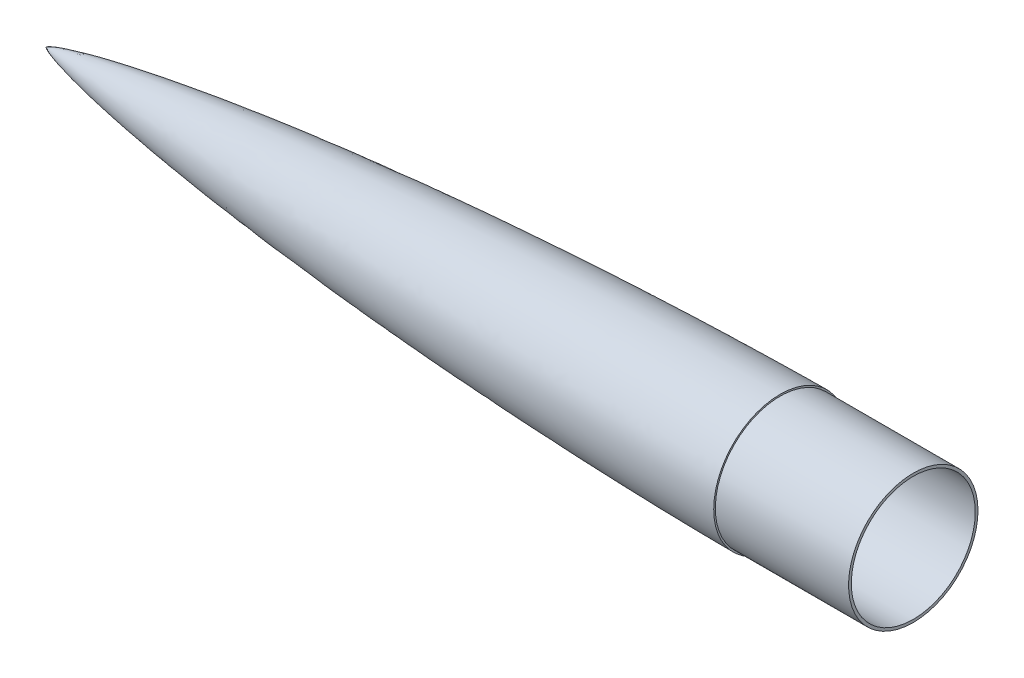
ISO-10303-21;
HEADER;
FILE_DESCRIPTION(('STEP AP214'),'2;1');
FILE_NAME('part.step','',(''),(''),'','','');
FILE_SCHEMA(('AUTOMOTIVE_DESIGN { 1 0 10303 214 1 1 1 1 }'));
ENDSEC;
DATA;
#1=APPLICATION_CONTEXT('core data for automotive mechanical design processes');
#2=APPLICATION_PROTOCOL_DEFINITION('international standard','automotive_design',2000,#1);
#3=PRODUCT_CONTEXT('',#1,'mechanical');
#4=PRODUCT('Part','Part','',(#3));
#5=PRODUCT_RELATED_PRODUCT_CATEGORY('part','',(#4));
#6=PRODUCT_DEFINITION_FORMATION('','',#4);
#7=PRODUCT_DEFINITION_CONTEXT('part definition',#1,'design');
#8=PRODUCT_DEFINITION('design','',#6,#7);
#9=PRODUCT_DEFINITION_SHAPE('','',#8);
#10=(LENGTH_UNIT() NAMED_UNIT(*) SI_UNIT(.MILLI.,.METRE.));
#11=(NAMED_UNIT(*) PLANE_ANGLE_UNIT() SI_UNIT($,.RADIAN.));
#12=(NAMED_UNIT(*) SI_UNIT($,.STERADIAN.) SOLID_ANGLE_UNIT());
#13=UNCERTAINTY_MEASURE_WITH_UNIT(LENGTH_MEASURE(1.E-05),#10,'distance_accuracy_value','');
#14=(GEOMETRIC_REPRESENTATION_CONTEXT(3) GLOBAL_UNCERTAINTY_ASSIGNED_CONTEXT((#13)) GLOBAL_UNIT_ASSIGNED_CONTEXT((#10,
#11,#12)) REPRESENTATION_CONTEXT('',''));
#15=CARTESIAN_POINT('',(0.,0.,0.));
#16=DIRECTION('',(0.,0.,1.));
#17=DIRECTION('',(1.,0.,0.));
#18=AXIS2_PLACEMENT_3D('',#15,#16,#17);
#19=CARTESIAN_POINT('',(-1.11022302462516E-13,50.8,0.));
#20=CARTESIAN_POINT('',(-2.14934923743526,50.7973507801545,0.));
#21=CARTESIAN_POINT('',(-6.44800999808848,50.7770624679067,0.));
#22=CARTESIAN_POINT('',(-15.0451777232877,50.7121883540089,0.));
#23=CARTESIAN_POINT('',(-32.3803918990792,50.5082144768032,0.));
#24=CARTESIAN_POINT('',(-56.3029065485733,50.090776648842,0.));
#25=CARTESIAN_POINT('',(-86.809787655482,49.3489831202033,0.));
#26=CARTESIAN_POINT('',(-121.747977164394,48.2271000379053,0.));
#27=CARTESIAN_POINT('',(-156.67647109036,46.8357681607493,0.));
#28=CARTESIAN_POINT('',(-191.593009434118,45.1706384633514,0.));
#29=CARTESIAN_POINT('',(-226.49494926724,43.2230355543889,0.));
#30=CARTESIAN_POINT('',(-261.379230807222,40.9803744355786,0.));
#31=CARTESIAN_POINT('',(-296.242069035725,38.425472621022,0.));
#32=CARTESIAN_POINT('',(-331.078892316415,35.5359559537165,0.));
#33=CARTESIAN_POINT('',(-365.883526915384,32.2808737670788,0.));
#34=CARTESIAN_POINT('',(-400.647967928913,28.6186220405836,0.));
#35=CARTESIAN_POINT('',(-435.35983834691,24.4860300966533,0.));
#36=CARTESIAN_POINT('',(-469.301869443746,19.8827350784447,0.));
#37=CARTESIAN_POINT('',(-498.824446520948,15.2498074933727,0.));
#38=CARTESIAN_POINT('',(-522.445985272802,10.9255150864351,0.));
#39=CARTESIAN_POINT('',(-538.983933312556,7.34770992266022,0.));
#40=CARTESIAN_POINT('',(-548.503001455136,4.95573700022913,0.));
#41=CARTESIAN_POINT('',(-554.236371735965,3.2830490655868,0.));
#42=CARTESIAN_POINT('',(-557.458840588358,2.19734023006858,0.));
#43=CARTESIAN_POINT('',(-559.255777461946,1.50550461272677,0.));
#44=CARTESIAN_POINT('',(-560.275927400277,1.06127371455853,0.));
#45=CARTESIAN_POINT('',(-560.840298469006,0.787022959066489,0.));
#46=CARTESIAN_POINT('',(-561.169653139726,0.611597666558901,0.));
#47=CARTESIAN_POINT('',(-561.38021405753,0.490628162270949,0.));
#48=CARTESIAN_POINT('',(-561.523808969643,0.403162175557425,0.));
#49=CARTESIAN_POINT('',(-561.648819363266,0.321264997558828,0.));
#50=CARTESIAN_POINT('',(-561.755310693662,0.245344087659571,0.));
#51=CARTESIAN_POINT('',(-561.843876844838,0.175539616491447,0.));
#52=CARTESIAN_POINT('',(-561.906151097484,0.120689544505142,0.));
#53=CARTESIAN_POINT('',(-561.951678038106,0.0740094476962299,0.));
#54=CARTESIAN_POINT('',(-561.981306411724,0.0368858399056971,0.));
#55=CARTESIAN_POINT('',(-561.99374148433,0.0166551926729426,0.));
#56=CARTESIAN_POINT('',(-561.99818744585,0.00568588730699545,0.));
#57=CARTESIAN_POINT('',(-562.,0.,0.));
#58=B_SPLINE_CURVE_WITH_KNOTS('',4,(#19,#20,#21,#22,#23,#24,#25,#26,#27,#28,#29,#30,#31,#32,#33,
#34,#35,#36,#37,#38,#39,#40,#41,#42,#43,#44,#45,#46,#47,#48,#49,#50,#51,#52,#53,#54,#55,#56,
#57),.UNSPECIFIED.,.F.,.F.,(5,1,1,1,1,1,1,1,1,1,1,1,1,1,1,1,1,1,1,1,1,1,1,1,1,1,1,1,1,1,1,1,1,1,
1,5),(0.,0.0151976977337696,0.0303953954675391,0.0607907909350783,0.122582570486079,
0.184374349992458,0.246166129185985,0.307957909017478,0.369749688256446,0.43154146726618,
0.493333246918285,0.555125027289001,0.616916805965979,0.678708584538909,0.740500363269972,
0.802292142714057,0.864083922076652,0.920889993828207,0.95178589022563,0.972065434254083,
0.983707285900985,0.990276130770751,0.994005292011036,0.99610267991479,0.997318404630745,
0.998141356988284,0.998440998609813,0.998740640231341,0.999035334859011,0.999330029486681,
0.999497522115011,0.99966501474334,0.99983250737167,0.999916253685835,0.999958126842918,1.),.UNSPECIFIED.);
#59=CARTESIAN_POINT('',(-562.,0.,0.));
#60=DIRECTION('',(-1.,0.,0.));
#61=AXIS1_PLACEMENT('',#59,#60);
#62=SURFACE_OF_REVOLUTION('',#58,#61);
#63=CARTESIAN_POINT('',(-562.,0.,0.));
#64=VERTEX_POINT('',#63);
#65=VERTEX_LOOP('',#64);
#66=FACE_BOUND('',#65,.T.);
#67=CARTESIAN_POINT('',(0.,0.,0.));
#68=DIRECTION('',(-1.,0.,0.));
#69=DIRECTION('',(0.,-1.,0.));
#70=AXIS2_PLACEMENT_3D('',#67,#68,#69);
#71=CIRCLE('',#70,50.8);
#72=CARTESIAN_POINT('',(0.,-50.8,0.));
#73=VERTEX_POINT('',#72);
#74=EDGE_CURVE('E41',#73,#73,#71,.T.);
#75=ORIENTED_EDGE('',*,*,#74,.T.);
#76=EDGE_LOOP('',(#75));
#77=FACE_BOUND('',#76,.T.);
#78=ADVANCED_FACE('F33',(#66,#77),#62,.T.);
#79=CARTESIAN_POINT('',(0.,0.,0.));
#80=DIRECTION('',(-1.,0.,0.));
#81=DIRECTION('',(0.,-1.,0.));
#82=AXIS2_PLACEMENT_3D('',#79,#80,#81);
#83=PLANE('',#82);
#84=CARTESIAN_POINT('',(0.,0.,0.));
#85=DIRECTION('',(-1.,0.,0.));
#86=DIRECTION('',(0.,-1.,0.));
#87=AXIS2_PLACEMENT_3D('',#84,#85,#86);
#88=CIRCLE('',#87,49.55);
#89=CARTESIAN_POINT('',(0.,-49.55,0.));
#90=VERTEX_POINT('',#89);
#91=EDGE_CURVE('E11',#90,#90,#88,.F.);
#92=ORIENTED_EDGE('',*,*,#91,.F.);
#93=EDGE_LOOP('',(#92));
#94=FACE_BOUND('',#93,.T.);
#95=ORIENTED_EDGE('',*,*,#74,.F.);
#96=EDGE_LOOP('',(#95));
#97=FACE_BOUND('',#96,.T.);
#98=ADVANCED_FACE('F88',(#94,#97),#83,.F.);
#99=CARTESIAN_POINT('',(102.,0.,0.));
#100=DIRECTION('',(-1.,0.,0.));
#101=DIRECTION('',(0.,0.,1.));
#102=AXIS2_PLACEMENT_3D('',#99,#100,#101);
#103=CYLINDRICAL_SURFACE('',#102,49.55);
#104=CARTESIAN_POINT('',(102.,0.,0.));
#105=DIRECTION('',(1.,0.,0.));
#106=DIRECTION('',(0.,0.,-1.));
#107=AXIS2_PLACEMENT_3D('',#104,#105,#106);
#108=CIRCLE('',#107,49.55);
#109=CARTESIAN_POINT('',(102.,0.,-49.55));
#110=VERTEX_POINT('',#109);
#111=EDGE_CURVE('E61',#110,#110,#108,.T.);
#112=ORIENTED_EDGE('',*,*,#111,.F.);
#113=EDGE_LOOP('',(#112));
#114=FACE_BOUND('',#113,.T.);
#115=ORIENTED_EDGE('',*,*,#91,.T.);
#116=EDGE_LOOP('',(#115));
#117=FACE_BOUND('',#116,.T.);
#118=ADVANCED_FACE('F85',(#114,#117),#103,.T.);
#119=CARTESIAN_POINT('',(102.,0.,0.));
#120=DIRECTION('',(1.,0.,0.));
#121=DIRECTION('',(0.,0.,-1.));
#122=AXIS2_PLACEMENT_3D('',#119,#120,#121);
#123=PLANE('',#122);
#124=CARTESIAN_POINT('',(102.,0.,0.));
#125=DIRECTION('',(1.,0.,0.));
#126=DIRECTION('',(0.,0.,-1.));
#127=AXIS2_PLACEMENT_3D('',#124,#125,#126);
#128=CIRCLE('',#127,47.45);
#129=CARTESIAN_POINT('',(102.,0.,-47.45));
#130=VERTEX_POINT('',#129);
#131=EDGE_CURVE('E58',#130,#130,#128,.T.);
#132=ORIENTED_EDGE('',*,*,#131,.F.);
#133=EDGE_LOOP('',(#132));
#134=FACE_BOUND('',#133,.T.);
#135=ORIENTED_EDGE('',*,*,#111,.T.);
#136=EDGE_LOOP('',(#135));
#137=FACE_BOUND('',#136,.T.);
#138=ADVANCED_FACE('F51',(#134,#137),#123,.T.);
#139=CARTESIAN_POINT('',(-1.11022302462516E-13,50.8,0.));
#140=CARTESIAN_POINT('',(-2.14934923743526,50.7973507801545,0.));
#141=CARTESIAN_POINT('',(-6.44800999808848,50.7770624679067,0.));
#142=CARTESIAN_POINT('',(-15.0451777232877,50.7121883540089,0.));
#143=CARTESIAN_POINT('',(-32.3803918990792,50.5082144768032,0.));
#144=CARTESIAN_POINT('',(-56.3029065485733,50.090776648842,0.));
#145=CARTESIAN_POINT('',(-86.809787655482,49.3489831202033,0.));
#146=CARTESIAN_POINT('',(-121.747977164394,48.2271000379053,0.));
#147=CARTESIAN_POINT('',(-156.67647109036,46.8357681607493,0.));
#148=CARTESIAN_POINT('',(-191.593009434118,45.1706384633514,0.));
#149=CARTESIAN_POINT('',(-226.49494926724,43.2230355543889,0.));
#150=CARTESIAN_POINT('',(-261.379230807222,40.9803744355786,0.));
#151=CARTESIAN_POINT('',(-296.242069035725,38.425472621022,0.));
#152=CARTESIAN_POINT('',(-331.078892316415,35.5359559537165,0.));
#153=CARTESIAN_POINT('',(-365.883526915384,32.2808737670788,0.));
#154=CARTESIAN_POINT('',(-400.647967928913,28.6186220405836,0.));
#155=CARTESIAN_POINT('',(-435.35983834691,24.4860300966533,0.));
#156=CARTESIAN_POINT('',(-469.301869443746,19.8827350784447,0.));
#157=CARTESIAN_POINT('',(-498.824446520948,15.2498074933727,0.));
#158=CARTESIAN_POINT('',(-522.445985272802,10.9255150864351,0.));
#159=CARTESIAN_POINT('',(-538.983933312556,7.34770992266022,0.));
#160=CARTESIAN_POINT('',(-548.503001455136,4.95573700022913,0.));
#161=CARTESIAN_POINT('',(-553.977475078638,3.35858113378033,0.));
#162=CARTESIAN_POINT('',(-556.666207046048,2.46337676864576,0.));
#163=CARTESIAN_POINT('',(-557.781972700868,2.05889256813271,0.));
#164=CARTESIAN_POINT('',(-558.023720538431,1.96940712096563,0.));
#165=B_SPLINE_CURVE_WITH_KNOTS('',4,(#139,#140,#141,#142,#143,#144,#145,#146,#147,#148,#149,
#150,#151,#152,#153,#154,#155,#156,#157,#158,#159,#160,#161,#162,#163,#164),.UNSPECIFIED.,.F.,
.F.,(5,1,1,1,1,1,1,1,1,1,1,1,1,1,1,1,1,1,1,1,1,1,5),(0.,0.0151976977337696,0.0303953954675391,
0.0607907909350783,0.122582570486079,0.184374349992458,0.246166129185985,0.307957909017478,
0.369749688256446,0.43154146726618,0.493333246918285,0.555125027289001,0.616916805965979,
0.678708584538909,0.740500363269972,0.802292142714057,0.864083922076652,0.920889993828207,
0.95178589022563,0.972065434254083,0.983707285900985,0.990276130770751,0.99209882836728),.UNSPECIFIED.);
#166=CARTESIAN_POINT('',(-562.,0.,0.));
#167=DIRECTION('',(-1.,0.,0.));
#168=AXIS1_PLACEMENT('',#166,#167);
#169=SURFACE_OF_REVOLUTION('',#165,#168);
#170=OFFSET_SURFACE('',#169,-2.1,.F.);
#171=CARTESIAN_POINT('',(-557.294724247706,0.,0.));
#172=VERTEX_POINT('',#171);
#173=VERTEX_LOOP('',#172);
#174=FACE_BOUND('',#173,.T.);
#175=CARTESIAN_POINT('',(-21.,0.,0.));
#176=DIRECTION('',(-1.,0.,0.));
#177=DIRECTION('',(0.,-1.,0.));
#178=AXIS2_PLACEMENT_3D('',#175,#176,#177);
#179=CIRCLE('',#178,48.5372882607637);
#180=CARTESIAN_POINT('',(-21.,-48.5372882607637,0.));
#181=VERTEX_POINT('',#180);
#182=EDGE_CURVE('E55',#181,#181,#179,.T.);
#183=ORIENTED_EDGE('',*,*,#182,.F.);
#184=EDGE_LOOP('',(#183));
#185=FACE_BOUND('',#184,.T.);
#186=ADVANCED_FACE('F47',(#174,#185),#170,.F.);
#187=CARTESIAN_POINT('',(-21.,0.,0.));
#188=DIRECTION('',(-1.,0.,0.));
#189=DIRECTION('',(0.,-1.,0.));
#190=AXIS2_PLACEMENT_3D('',#187,#188,#189);
#191=PLANE('',#190);
#192=CARTESIAN_POINT('',(-21.,0.,0.));
#193=DIRECTION('',(-1.,0.,0.));
#194=DIRECTION('',(0.,-1.,0.));
#195=AXIS2_PLACEMENT_3D('',#192,#193,#194);
#196=CIRCLE('',#195,47.45);
#197=CARTESIAN_POINT('',(-21.,-47.45,0.));
#198=VERTEX_POINT('',#197);
#199=EDGE_CURVE('E57',#198,#198,#196,.F.);
#200=ORIENTED_EDGE('',*,*,#199,.T.);
#201=EDGE_LOOP('',(#200));
#202=FACE_BOUND('',#201,.T.);
#203=ORIENTED_EDGE('',*,*,#182,.T.);
#204=EDGE_LOOP('',(#203));
#205=FACE_BOUND('',#204,.T.);
#206=ADVANCED_FACE('F50',(#202,#205),#191,.T.);
#207=CARTESIAN_POINT('',(102.,0.,0.));
#208=DIRECTION('',(-1.,0.,0.));
#209=DIRECTION('',(0.,0.,1.));
#210=AXIS2_PLACEMENT_3D('',#207,#208,#209);
#211=CYLINDRICAL_SURFACE('',#210,47.45);
#212=ORIENTED_EDGE('',*,*,#131,.T.);
#213=EDGE_LOOP('',(#212));
#214=FACE_BOUND('',#213,.T.);
#215=ORIENTED_EDGE('',*,*,#199,.F.);
#216=EDGE_LOOP('',(#215));
#217=FACE_BOUND('',#216,.T.);
#218=ADVANCED_FACE('F78',(#214,#217),#211,.F.);
#219=CLOSED_SHELL('',(#78,#98,#118,#138,#186,#206,#218));
#220=MANIFOLD_SOLID_BREP('B2',#219);
#221=ADVANCED_BREP_SHAPE_REPRESENTATION('',(#18,#220),#14);
#222=SHAPE_DEFINITION_REPRESENTATION(#9,#221);
ENDSEC;
END-ISO-10303-21;
